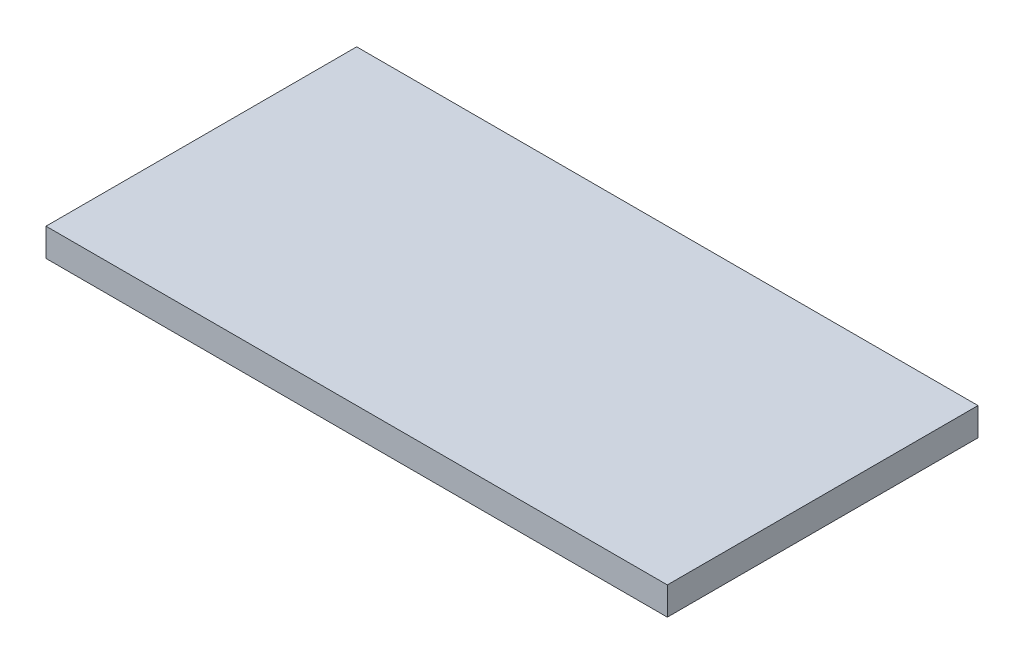
ISO-10303-21;
HEADER;
FILE_DESCRIPTION(('STEP AP214'),'2;1');
FILE_NAME('part.step','',(''),(''),'','','');
FILE_SCHEMA(('AUTOMOTIVE_DESIGN { 1 0 10303 214 1 1 1 1 }'));
ENDSEC;
DATA;
#1=APPLICATION_CONTEXT('core data for automotive mechanical design processes');
#2=APPLICATION_PROTOCOL_DEFINITION('international standard','automotive_design',2000,#1);
#3=PRODUCT_CONTEXT('',#1,'mechanical');
#4=PRODUCT('Part','Part','',(#3));
#5=PRODUCT_RELATED_PRODUCT_CATEGORY('part','',(#4));
#6=PRODUCT_DEFINITION_FORMATION('','',#4);
#7=PRODUCT_DEFINITION_CONTEXT('part definition',#1,'design');
#8=PRODUCT_DEFINITION('design','',#6,#7);
#9=PRODUCT_DEFINITION_SHAPE('','',#8);
#10=(LENGTH_UNIT() NAMED_UNIT(*) SI_UNIT(.MILLI.,.METRE.));
#11=(NAMED_UNIT(*) PLANE_ANGLE_UNIT() SI_UNIT($,.RADIAN.));
#12=(NAMED_UNIT(*) SI_UNIT($,.STERADIAN.) SOLID_ANGLE_UNIT());
#13=UNCERTAINTY_MEASURE_WITH_UNIT(LENGTH_MEASURE(1.E-05),#10,'distance_accuracy_value','');
#14=(GEOMETRIC_REPRESENTATION_CONTEXT(3) GLOBAL_UNCERTAINTY_ASSIGNED_CONTEXT((#13)) GLOBAL_UNIT_ASSIGNED_CONTEXT((#10,
#11,#12)) REPRESENTATION_CONTEXT('',''));
#15=CARTESIAN_POINT('',(0.,0.,0.));
#16=DIRECTION('',(0.,0.,1.));
#17=DIRECTION('',(1.,0.,0.));
#18=AXIS2_PLACEMENT_3D('',#15,#16,#17);
#19=CARTESIAN_POINT('',(0.,3.6,0.));
#20=DIRECTION('',(1.,0.,0.));
#21=DIRECTION('',(0.,0.,-1.));
#22=AXIS2_PLACEMENT_3D('',#19,#20,#21);
#23=PLANE('',#22);
#24=DIRECTION('',(0.,0.,1.));
#25=VECTOR('',#24,1.);
#26=CARTESIAN_POINT('',(0.,0.,0.));
#27=LINE('',#26,#25);
#28=CARTESIAN_POINT('',(0.,0.,0.));
#29=VERTEX_POINT('',#28);
#30=CARTESIAN_POINT('',(0.,0.,40.));
#31=VERTEX_POINT('',#30);
#32=EDGE_CURVE('E102',#29,#31,#27,.T.);
#33=ORIENTED_EDGE('',*,*,#32,.T.);
#34=DIRECTION('',(0.,-1.,0.));
#35=VECTOR('',#34,1.);
#36=CARTESIAN_POINT('',(0.,3.6,40.));
#37=LINE('',#36,#35);
#38=CARTESIAN_POINT('',(0.,3.6,40.));
#39=VERTEX_POINT('',#38);
#40=EDGE_CURVE('E11',#39,#31,#37,.T.);
#41=ORIENTED_EDGE('',*,*,#40,.F.);
#42=DIRECTION('',(0.,0.,1.));
#43=VECTOR('',#42,1.);
#44=CARTESIAN_POINT('',(0.,3.6,0.));
#45=LINE('',#44,#43);
#46=CARTESIAN_POINT('',(0.,3.6,0.));
#47=VERTEX_POINT('',#46);
#48=EDGE_CURVE('E90',#47,#39,#45,.T.);
#49=ORIENTED_EDGE('',*,*,#48,.F.);
#50=DIRECTION('',(0.,-1.,0.));
#51=VECTOR('',#50,1.);
#52=CARTESIAN_POINT('',(0.,3.6,0.));
#53=LINE('',#52,#51);
#54=EDGE_CURVE('E98',#47,#29,#53,.T.);
#55=ORIENTED_EDGE('',*,*,#54,.T.);
#56=EDGE_LOOP('',(#33,#41,#49,#55));
#57=FACE_BOUND('',#56,.T.);
#58=ADVANCED_FACE('F39',(#57),#23,.F.);
#59=CARTESIAN_POINT('',(0.,3.6,40.));
#60=DIRECTION('',(0.,0.,-1.));
#61=DIRECTION('',(-1.,0.,0.));
#62=AXIS2_PLACEMENT_3D('',#59,#60,#61);
#63=PLANE('',#62);
#64=DIRECTION('',(1.,0.,0.));
#65=VECTOR('',#64,1.);
#66=CARTESIAN_POINT('',(0.,0.,40.));
#67=LINE('',#66,#65);
#68=CARTESIAN_POINT('',(80.,0.,40.));
#69=VERTEX_POINT('',#68);
#70=EDGE_CURVE('E94',#31,#69,#67,.T.);
#71=ORIENTED_EDGE('',*,*,#70,.T.);
#72=DIRECTION('',(0.,-1.,0.));
#73=VECTOR('',#72,1.);
#74=CARTESIAN_POINT('',(80.,3.6,40.));
#75=LINE('',#74,#73);
#76=CARTESIAN_POINT('',(80.,3.6,40.));
#77=VERTEX_POINT('',#76);
#78=EDGE_CURVE('E47',#77,#69,#75,.T.);
#79=ORIENTED_EDGE('',*,*,#78,.F.);
#80=DIRECTION('',(1.,0.,0.));
#81=VECTOR('',#80,1.);
#82=CARTESIAN_POINT('',(0.,3.6,40.));
#83=LINE('',#82,#81);
#84=EDGE_CURVE('E85',#39,#77,#83,.T.);
#85=ORIENTED_EDGE('',*,*,#84,.F.);
#86=ORIENTED_EDGE('',*,*,#40,.T.);
#87=EDGE_LOOP('',(#71,#79,#85,#86));
#88=FACE_BOUND('',#87,.T.);
#89=ADVANCED_FACE('F93',(#88),#63,.F.);
#90=CARTESIAN_POINT('',(80.,3.6,0.));
#91=DIRECTION('',(-1.,0.,0.));
#92=DIRECTION('',(0.,0.,1.));
#93=AXIS2_PLACEMENT_3D('',#90,#91,#92);
#94=PLANE('',#93);
#95=DIRECTION('',(0.,0.,-1.));
#96=VECTOR('',#95,1.);
#97=CARTESIAN_POINT('',(80.,0.,0.));
#98=LINE('',#97,#96);
#99=CARTESIAN_POINT('',(80.,0.,0.));
#100=VERTEX_POINT('',#99);
#101=EDGE_CURVE('E72',#69,#100,#98,.T.);
#102=ORIENTED_EDGE('',*,*,#101,.T.);
#103=DIRECTION('',(0.,-1.,0.));
#104=VECTOR('',#103,1.);
#105=CARTESIAN_POINT('',(80.,3.6,0.));
#106=LINE('',#105,#104);
#107=CARTESIAN_POINT('',(80.,3.6,0.));
#108=VERTEX_POINT('',#107);
#109=EDGE_CURVE('E95',#108,#100,#106,.T.);
#110=ORIENTED_EDGE('',*,*,#109,.F.);
#111=DIRECTION('',(0.,0.,-1.));
#112=VECTOR('',#111,1.);
#113=CARTESIAN_POINT('',(80.,3.6,0.));
#114=LINE('',#113,#112);
#115=EDGE_CURVE('E88',#77,#108,#114,.T.);
#116=ORIENTED_EDGE('',*,*,#115,.F.);
#117=ORIENTED_EDGE('',*,*,#78,.T.);
#118=EDGE_LOOP('',(#102,#110,#116,#117));
#119=FACE_BOUND('',#118,.T.);
#120=ADVANCED_FACE('F96',(#119),#94,.F.);
#121=CARTESIAN_POINT('',(0.,3.6,0.));
#122=DIRECTION('',(0.,0.,1.));
#123=DIRECTION('',(1.,0.,0.));
#124=AXIS2_PLACEMENT_3D('',#121,#122,#123);
#125=PLANE('',#124);
#126=DIRECTION('',(-1.,0.,0.));
#127=VECTOR('',#126,1.);
#128=CARTESIAN_POINT('',(0.,0.,0.));
#129=LINE('',#128,#127);
#130=EDGE_CURVE('E78',#100,#29,#129,.T.);
#131=ORIENTED_EDGE('',*,*,#130,.T.);
#132=ORIENTED_EDGE('',*,*,#54,.F.);
#133=DIRECTION('',(-1.,0.,0.));
#134=VECTOR('',#133,1.);
#135=CARTESIAN_POINT('',(0.,3.6,0.));
#136=LINE('',#135,#134);
#137=EDGE_CURVE('E55',#108,#47,#136,.T.);
#138=ORIENTED_EDGE('',*,*,#137,.F.);
#139=ORIENTED_EDGE('',*,*,#109,.T.);
#140=EDGE_LOOP('',(#131,#132,#138,#139));
#141=FACE_BOUND('',#140,.T.);
#142=ADVANCED_FACE('F109',(#141),#125,.F.);
#143=CARTESIAN_POINT('',(0.,3.6,0.));
#144=DIRECTION('',(0.,1.,0.));
#145=DIRECTION('',(0.,0.,1.));
#146=AXIS2_PLACEMENT_3D('',#143,#144,#145);
#147=PLANE('',#146);
#148=ORIENTED_EDGE('',*,*,#48,.T.);
#149=ORIENTED_EDGE('',*,*,#84,.T.);
#150=ORIENTED_EDGE('',*,*,#115,.T.);
#151=ORIENTED_EDGE('',*,*,#137,.T.);
#152=EDGE_LOOP('',(#148,#149,#150,#151));
#153=FACE_BOUND('',#152,.T.);
#154=ADVANCED_FACE('F86',(#153),#147,.T.);
#155=CARTESIAN_POINT('',(0.,0.,0.));
#156=DIRECTION('',(0.,1.,0.));
#157=DIRECTION('',(0.,0.,1.));
#158=AXIS2_PLACEMENT_3D('',#155,#156,#157);
#159=PLANE('',#158);
#160=ORIENTED_EDGE('',*,*,#32,.F.);
#161=ORIENTED_EDGE('',*,*,#130,.F.);
#162=ORIENTED_EDGE('',*,*,#101,.F.);
#163=ORIENTED_EDGE('',*,*,#70,.F.);
#164=EDGE_LOOP('',(#160,#161,#162,#163));
#165=FACE_BOUND('',#164,.T.);
#166=ADVANCED_FACE('F112',(#165),#159,.F.);
#167=CLOSED_SHELL('',(#58,#89,#120,#142,#154,#166));
#168=MANIFOLD_SOLID_BREP('B2',#167);
#169=ADVANCED_BREP_SHAPE_REPRESENTATION('',(#18,#168),#14);
#170=SHAPE_DEFINITION_REPRESENTATION(#9,#169);
ENDSEC;
END-ISO-10303-21;
